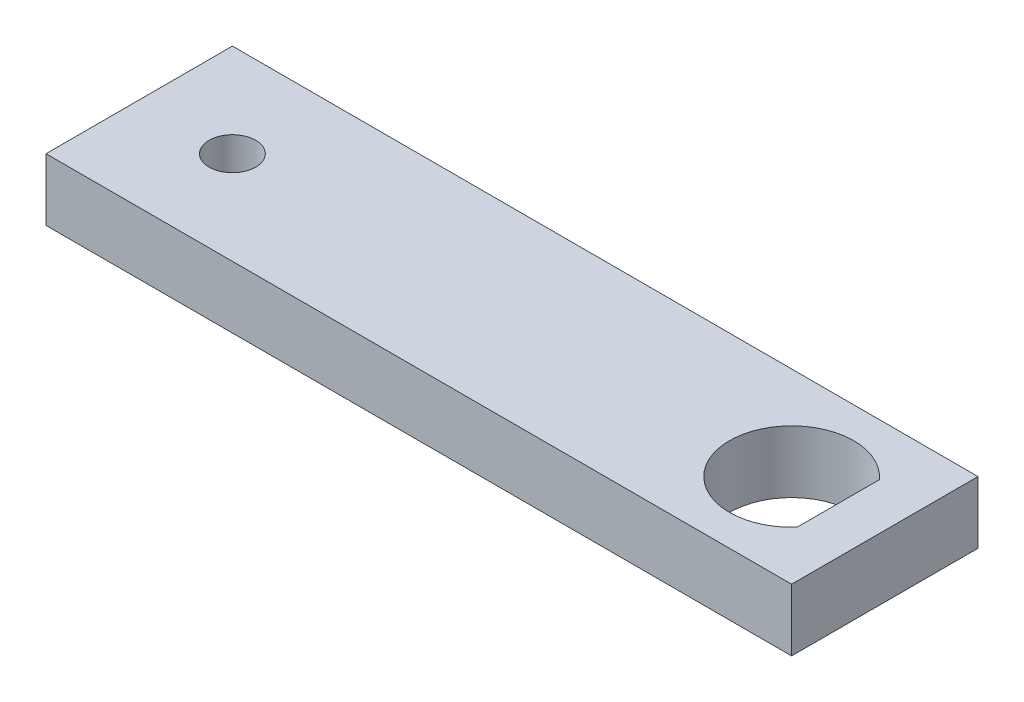
ISO-10303-21;
HEADER;
FILE_DESCRIPTION(('STEP AP214'),'2;1');
FILE_NAME('part.step','',(''),(''),'','','');
FILE_SCHEMA(('AUTOMOTIVE_DESIGN { 1 0 10303 214 1 1 1 1 }'));
ENDSEC;
DATA;
#1=APPLICATION_CONTEXT('core data for automotive mechanical design processes');
#2=APPLICATION_PROTOCOL_DEFINITION('international standard','automotive_design',2000,#1);
#3=PRODUCT_CONTEXT('',#1,'mechanical');
#4=PRODUCT('Part','Part','',(#3));
#5=PRODUCT_RELATED_PRODUCT_CATEGORY('part','',(#4));
#6=PRODUCT_DEFINITION_FORMATION('','',#4);
#7=PRODUCT_DEFINITION_CONTEXT('part definition',#1,'design');
#8=PRODUCT_DEFINITION('design','',#6,#7);
#9=PRODUCT_DEFINITION_SHAPE('','',#8);
#10=(LENGTH_UNIT() NAMED_UNIT(*) SI_UNIT(.MILLI.,.METRE.));
#11=(NAMED_UNIT(*) PLANE_ANGLE_UNIT() SI_UNIT($,.RADIAN.));
#12=(NAMED_UNIT(*) SI_UNIT($,.STERADIAN.) SOLID_ANGLE_UNIT());
#13=UNCERTAINTY_MEASURE_WITH_UNIT(LENGTH_MEASURE(1.E-05),#10,'distance_accuracy_value','');
#14=(GEOMETRIC_REPRESENTATION_CONTEXT(3) GLOBAL_UNCERTAINTY_ASSIGNED_CONTEXT((#13)) GLOBAL_UNIT_ASSIGNED_CONTEXT((#10,
#11,#12)) REPRESENTATION_CONTEXT('',''));
#15=CARTESIAN_POINT('',(0.,0.,0.));
#16=DIRECTION('',(0.,0.,1.));
#17=DIRECTION('',(1.,0.,0.));
#18=AXIS2_PLACEMENT_3D('',#15,#16,#17);
#19=CARTESIAN_POINT('',(0.,0.,19.05));
#20=DIRECTION('',(-1.,0.,0.));
#21=DIRECTION('',(0.,0.,1.));
#22=AXIS2_PLACEMENT_3D('',#19,#20,#21);
#23=PLANE('',#22);
#24=DIRECTION('',(0.,1.,0.));
#25=VECTOR('',#24,1.);
#26=CARTESIAN_POINT('',(0.,0.,0.));
#27=LINE('',#26,#25);
#28=CARTESIAN_POINT('',(0.,0.,0.));
#29=VERTEX_POINT('',#28);
#30=CARTESIAN_POINT('',(0.,6.35000000000002,0.));
#31=VERTEX_POINT('',#30);
#32=EDGE_CURVE('E92',#29,#31,#27,.T.);
#33=ORIENTED_EDGE('',*,*,#32,.F.);
#34=DIRECTION('',(0.,0.,-1.));
#35=VECTOR('',#34,1.);
#36=CARTESIAN_POINT('',(0.,0.,19.05));
#37=LINE('',#36,#35);
#38=CARTESIAN_POINT('',(0.,0.,19.05));
#39=VERTEX_POINT('',#38);
#40=EDGE_CURVE('E11',#39,#29,#37,.T.);
#41=ORIENTED_EDGE('',*,*,#40,.F.);
#42=DIRECTION('',(0.,1.,0.));
#43=VECTOR('',#42,1.);
#44=CARTESIAN_POINT('',(0.,0.,19.05));
#45=LINE('',#44,#43);
#46=CARTESIAN_POINT('',(0.,6.35000000000002,19.05));
#47=VERTEX_POINT('',#46);
#48=EDGE_CURVE('E125',#39,#47,#45,.T.);
#49=ORIENTED_EDGE('',*,*,#48,.T.);
#50=DIRECTION('',(0.,0.,-1.));
#51=VECTOR('',#50,1.);
#52=CARTESIAN_POINT('',(0.,6.35000000000002,19.05));
#53=LINE('',#52,#51);
#54=EDGE_CURVE('E40',#47,#31,#53,.T.);
#55=ORIENTED_EDGE('',*,*,#54,.T.);
#56=EDGE_LOOP('',(#33,#41,#49,#55));
#57=FACE_BOUND('',#56,.T.);
#58=ADVANCED_FACE('F37',(#57),#23,.T.);
#59=CARTESIAN_POINT('',(0.,0.,19.05));
#60=DIRECTION('',(0.,1.,0.));
#61=DIRECTION('',(-1.,0.,0.));
#62=AXIS2_PLACEMENT_3D('',#59,#60,#61);
#63=PLANE('',#62);
#64=CARTESIAN_POINT('',(9.52500000000001,0.,9.52500000000001));
#65=DIRECTION('',(0.,1.,0.));
#66=DIRECTION('',(-1.,0.,0.));
#67=AXIS2_PLACEMENT_3D('',#64,#65,#66);
#68=CIRCLE('',#67,2.38125);
#69=CARTESIAN_POINT('',(7.14375000000001,0.,9.52500000000001));
#70=VERTEX_POINT('',#69);
#71=EDGE_CURVE('E102',#70,#70,#68,.T.);
#72=ORIENTED_EDGE('',*,*,#71,.T.);
#73=EDGE_LOOP('',(#72));
#74=FACE_BOUND('',#73,.T.);
#75=DIRECTION('',(0.,0.,1.));
#76=VECTOR('',#75,1.);
#77=CARTESIAN_POINT('',(71.4375,0.,5.32486979368498));
#78=LINE('',#77,#76);
#79=CARTESIAN_POINT('',(71.4375,0.,5.32486979368498));
#80=VERTEX_POINT('',#79);
#81=CARTESIAN_POINT('',(71.4375,0.,13.725130206315));
#82=VERTEX_POINT('',#81);
#83=EDGE_CURVE('E110',#80,#82,#78,.T.);
#84=ORIENTED_EDGE('',*,*,#83,.F.);
#85=CARTESIAN_POINT('',(66.675,0.,9.52500000000002));
#86=DIRECTION('',(0.,1.,0.));
#87=DIRECTION('',(-1.,0.,0.));
#88=AXIS2_PLACEMENT_3D('',#85,#86,#87);
#89=CIRCLE('',#88,6.35);
#90=EDGE_CURVE('E53',#80,#82,#89,.T.);
#91=ORIENTED_EDGE('',*,*,#90,.T.);
#92=EDGE_LOOP('',(#84,#91));
#93=FACE_BOUND('',#92,.T.);
#94=DIRECTION('',(1.,0.,0.));
#95=VECTOR('',#94,1.);
#96=CARTESIAN_POINT('',(0.,0.,0.));
#97=LINE('',#96,#95);
#98=CARTESIAN_POINT('',(76.2,0.,0.));
#99=VERTEX_POINT('',#98);
#100=EDGE_CURVE('E121',#29,#99,#97,.T.);
#101=ORIENTED_EDGE('',*,*,#100,.T.);
#102=DIRECTION('',(0.,0.,-1.));
#103=VECTOR('',#102,1.);
#104=CARTESIAN_POINT('',(76.2,0.,19.05));
#105=LINE('',#104,#103);
#106=CARTESIAN_POINT('',(76.2,0.,19.05));
#107=VERTEX_POINT('',#106);
#108=EDGE_CURVE('E45',#107,#99,#105,.T.);
#109=ORIENTED_EDGE('',*,*,#108,.F.);
#110=DIRECTION('',(1.,0.,0.));
#111=VECTOR('',#110,1.);
#112=CARTESIAN_POINT('',(0.,0.,19.05));
#113=LINE('',#112,#111);
#114=EDGE_CURVE('E133',#39,#107,#113,.T.);
#115=ORIENTED_EDGE('',*,*,#114,.F.);
#116=ORIENTED_EDGE('',*,*,#40,.T.);
#117=EDGE_LOOP('',(#101,#109,#115,#116));
#118=FACE_BOUND('',#117,.T.);
#119=ADVANCED_FACE('F148',(#74,#93,#118),#63,.F.);
#120=CARTESIAN_POINT('',(76.2,6.35000000000002,19.05));
#121=DIRECTION('',(1.,0.,0.));
#122=DIRECTION('',(0.,0.,-1.));
#123=AXIS2_PLACEMENT_3D('',#120,#121,#122);
#124=PLANE('',#123);
#125=DIRECTION('',(0.,-1.,0.));
#126=VECTOR('',#125,1.);
#127=CARTESIAN_POINT('',(76.2,6.35000000000002,0.));
#128=LINE('',#127,#126);
#129=CARTESIAN_POINT('',(76.2,6.35000000000002,0.));
#130=VERTEX_POINT('',#129);
#131=EDGE_CURVE('E118',#130,#99,#128,.T.);
#132=ORIENTED_EDGE('',*,*,#131,.F.);
#133=DIRECTION('',(0.,0.,-1.));
#134=VECTOR('',#133,1.);
#135=CARTESIAN_POINT('',(76.2,6.35000000000002,19.05));
#136=LINE('',#135,#134);
#137=CARTESIAN_POINT('',(76.2,6.35000000000002,19.05));
#138=VERTEX_POINT('',#137);
#139=EDGE_CURVE('E135',#138,#130,#136,.T.);
#140=ORIENTED_EDGE('',*,*,#139,.F.);
#141=DIRECTION('',(0.,-1.,0.));
#142=VECTOR('',#141,1.);
#143=CARTESIAN_POINT('',(76.2,6.35000000000002,19.05));
#144=LINE('',#143,#142);
#145=EDGE_CURVE('E130',#138,#107,#144,.T.);
#146=ORIENTED_EDGE('',*,*,#145,.T.);
#147=ORIENTED_EDGE('',*,*,#108,.T.);
#148=EDGE_LOOP('',(#132,#140,#146,#147));
#149=FACE_BOUND('',#148,.T.);
#150=ADVANCED_FACE('F154',(#149),#124,.T.);
#151=CARTESIAN_POINT('',(76.2,6.35000000000002,19.05));
#152=DIRECTION('',(0.,-1.,0.));
#153=DIRECTION('',(1.,0.,0.));
#154=AXIS2_PLACEMENT_3D('',#151,#152,#153);
#155=PLANE('',#154);
#156=CARTESIAN_POINT('',(9.52500000000001,6.35000000000002,9.52500000000001));
#157=DIRECTION('',(0.,1.,0.));
#158=DIRECTION('',(-1.,0.,0.));
#159=AXIS2_PLACEMENT_3D('',#156,#157,#158);
#160=CIRCLE('',#159,2.38125);
#161=CARTESIAN_POINT('',(7.14375000000001,6.35000000000002,9.52500000000001));
#162=VERTEX_POINT('',#161);
#163=EDGE_CURVE('E105',#162,#162,#160,.T.);
#164=ORIENTED_EDGE('',*,*,#163,.F.);
#165=EDGE_LOOP('',(#164));
#166=FACE_BOUND('',#165,.T.);
#167=DIRECTION('',(0.,0.,1.));
#168=VECTOR('',#167,1.);
#169=CARTESIAN_POINT('',(71.4375,6.35000000000002,5.32486979368498));
#170=LINE('',#169,#168);
#171=CARTESIAN_POINT('',(71.4375,6.35000000000002,5.32486979368498));
#172=VERTEX_POINT('',#171);
#173=CARTESIAN_POINT('',(71.4375,6.35000000000002,13.725130206315));
#174=VERTEX_POINT('',#173);
#175=EDGE_CURVE('E96',#172,#174,#170,.T.);
#176=ORIENTED_EDGE('',*,*,#175,.T.);
#177=CARTESIAN_POINT('',(66.675,6.35000000000002,9.52500000000002));
#178=DIRECTION('',(0.,1.,0.));
#179=DIRECTION('',(-1.,0.,0.));
#180=AXIS2_PLACEMENT_3D('',#177,#178,#179);
#181=CIRCLE('',#180,6.35);
#182=EDGE_CURVE('E58',#172,#174,#181,.T.);
#183=ORIENTED_EDGE('',*,*,#182,.F.);
#184=EDGE_LOOP('',(#176,#183));
#185=FACE_BOUND('',#184,.T.);
#186=DIRECTION('',(-1.,0.,0.));
#187=VECTOR('',#186,1.);
#188=CARTESIAN_POINT('',(76.2,6.35000000000002,0.));
#189=LINE('',#188,#187);
#190=EDGE_CURVE('E115',#130,#31,#189,.T.);
#191=ORIENTED_EDGE('',*,*,#190,.T.);
#192=ORIENTED_EDGE('',*,*,#54,.F.);
#193=DIRECTION('',(-1.,0.,0.));
#194=VECTOR('',#193,1.);
#195=CARTESIAN_POINT('',(76.2,6.35000000000002,19.05));
#196=LINE('',#195,#194);
#197=EDGE_CURVE('E128',#138,#47,#196,.T.);
#198=ORIENTED_EDGE('',*,*,#197,.F.);
#199=ORIENTED_EDGE('',*,*,#139,.T.);
#200=EDGE_LOOP('',(#191,#192,#198,#199));
#201=FACE_BOUND('',#200,.T.);
#202=ADVANCED_FACE('F100',(#166,#185,#201),#155,.F.);
#203=CARTESIAN_POINT('',(0.,0.,19.05));
#204=DIRECTION('',(0.,0.,-1.));
#205=DIRECTION('',(-1.,0.,0.));
#206=AXIS2_PLACEMENT_3D('',#203,#204,#205);
#207=PLANE('',#206);
#208=ORIENTED_EDGE('',*,*,#48,.F.);
#209=ORIENTED_EDGE('',*,*,#114,.T.);
#210=ORIENTED_EDGE('',*,*,#145,.F.);
#211=ORIENTED_EDGE('',*,*,#197,.T.);
#212=EDGE_LOOP('',(#208,#209,#210,#211));
#213=FACE_BOUND('',#212,.T.);
#214=ADVANCED_FACE('F152',(#213),#207,.F.);
#215=CARTESIAN_POINT('',(0.,0.,0.));
#216=DIRECTION('',(0.,0.,-1.));
#217=DIRECTION('',(-1.,0.,0.));
#218=AXIS2_PLACEMENT_3D('',#215,#216,#217);
#219=PLANE('',#218);
#220=ORIENTED_EDGE('',*,*,#32,.T.);
#221=ORIENTED_EDGE('',*,*,#190,.F.);
#222=ORIENTED_EDGE('',*,*,#131,.T.);
#223=ORIENTED_EDGE('',*,*,#100,.F.);
#224=EDGE_LOOP('',(#220,#221,#222,#223));
#225=FACE_BOUND('',#224,.T.);
#226=ADVANCED_FACE('F145',(#225),#219,.T.);
#227=CARTESIAN_POINT('',(66.675,0.,9.52500000000002));
#228=DIRECTION('',(0.,1.,0.));
#229=DIRECTION('',(-1.,0.,0.));
#230=AXIS2_PLACEMENT_3D('',#227,#228,#229);
#231=CYLINDRICAL_SURFACE('',#230,6.35);
#232=ORIENTED_EDGE('',*,*,#182,.T.);
#233=DIRECTION('',(0.,1.,0.));
#234=VECTOR('',#233,1.);
#235=CARTESIAN_POINT('',(71.4375,0.,13.725130206315));
#236=LINE('',#235,#234);
#237=EDGE_CURVE('E93',#82,#174,#236,.T.);
#238=ORIENTED_EDGE('',*,*,#237,.F.);
#239=ORIENTED_EDGE('',*,*,#90,.F.);
#240=DIRECTION('',(0.,1.,0.));
#241=VECTOR('',#240,1.);
#242=CARTESIAN_POINT('',(71.4375,0.,5.32486979368498));
#243=LINE('',#242,#241);
#244=EDGE_CURVE('E87',#80,#172,#243,.T.);
#245=ORIENTED_EDGE('',*,*,#244,.T.);
#246=EDGE_LOOP('',(#232,#238,#239,#245));
#247=FACE_BOUND('',#246,.T.);
#248=ADVANCED_FACE('F89',(#247),#231,.F.);
#249=CARTESIAN_POINT('',(71.4375,0.,5.32486979368498));
#250=DIRECTION('',(-1.,0.,0.));
#251=DIRECTION('',(0.,-1.,0.));
#252=AXIS2_PLACEMENT_3D('',#249,#250,#251);
#253=PLANE('',#252);
#254=ORIENTED_EDGE('',*,*,#175,.F.);
#255=ORIENTED_EDGE('',*,*,#244,.F.);
#256=ORIENTED_EDGE('',*,*,#83,.T.);
#257=ORIENTED_EDGE('',*,*,#237,.T.);
#258=EDGE_LOOP('',(#254,#255,#256,#257));
#259=FACE_BOUND('',#258,.T.);
#260=ADVANCED_FACE('F97',(#259),#253,.T.);
#261=CARTESIAN_POINT('',(9.52500000000001,0.,9.52500000000001));
#262=DIRECTION('',(0.,1.,0.));
#263=DIRECTION('',(-1.,0.,0.));
#264=AXIS2_PLACEMENT_3D('',#261,#262,#263);
#265=CYLINDRICAL_SURFACE('',#264,2.38125);
#266=ORIENTED_EDGE('',*,*,#71,.F.);
#267=EDGE_LOOP('',(#266));
#268=FACE_BOUND('',#267,.T.);
#269=ORIENTED_EDGE('',*,*,#163,.T.);
#270=EDGE_LOOP('',(#269));
#271=FACE_BOUND('',#270,.T.);
#272=ADVANCED_FACE('F208',(#268,#271),#265,.F.);
#273=CLOSED_SHELL('',(#58,#119,#150,#202,#214,#226,#248,#260,#272));
#274=MANIFOLD_SOLID_BREP('B2',#273);
#275=ADVANCED_BREP_SHAPE_REPRESENTATION('',(#18,#274),#14);
#276=SHAPE_DEFINITION_REPRESENTATION(#9,#275);
ENDSEC;
END-ISO-10303-21;
